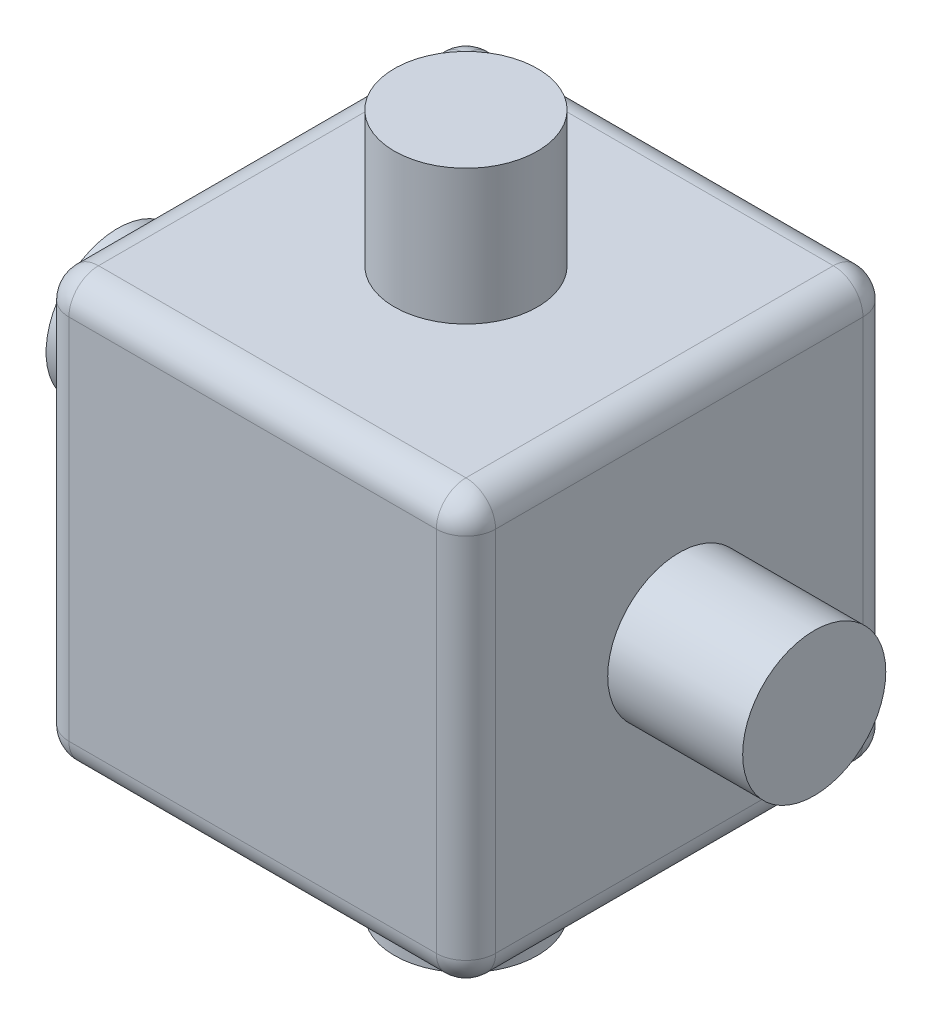
ISO-10303-21;
HEADER;
FILE_DESCRIPTION(('STEP AP214'),'2;1');
FILE_NAME('part.step','',(''),(''),'','','');
FILE_SCHEMA(('AUTOMOTIVE_DESIGN { 1 0 10303 214 1 1 1 1 }'));
ENDSEC;
DATA;
#1=APPLICATION_CONTEXT('core data for automotive mechanical design processes');
#2=APPLICATION_PROTOCOL_DEFINITION('international standard','automotive_design',2000,#1);
#3=PRODUCT_CONTEXT('',#1,'mechanical');
#4=PRODUCT('Part','Part','',(#3));
#5=PRODUCT_RELATED_PRODUCT_CATEGORY('part','',(#4));
#6=PRODUCT_DEFINITION_FORMATION('','',#4);
#7=PRODUCT_DEFINITION_CONTEXT('part definition',#1,'design');
#8=PRODUCT_DEFINITION('design','',#6,#7);
#9=PRODUCT_DEFINITION_SHAPE('','',#8);
#10=(LENGTH_UNIT() NAMED_UNIT(*) SI_UNIT(.MILLI.,.METRE.));
#11=(NAMED_UNIT(*) PLANE_ANGLE_UNIT() SI_UNIT($,.RADIAN.));
#12=(NAMED_UNIT(*) SI_UNIT($,.STERADIAN.) SOLID_ANGLE_UNIT());
#13=UNCERTAINTY_MEASURE_WITH_UNIT(LENGTH_MEASURE(1.E-05),#10,'distance_accuracy_value','');
#14=(GEOMETRIC_REPRESENTATION_CONTEXT(3) GLOBAL_UNCERTAINTY_ASSIGNED_CONTEXT((#13)) GLOBAL_UNIT_ASSIGNED_CONTEXT((#10,
#11,#12)) REPRESENTATION_CONTEXT('',''));
#15=CARTESIAN_POINT('',(0.,0.,0.));
#16=DIRECTION('',(0.,0.,1.));
#17=DIRECTION('',(1.,0.,0.));
#18=AXIS2_PLACEMENT_3D('',#15,#16,#17);
#19=CARTESIAN_POINT('',(7.2,7.2,7.2));
#20=DIRECTION('',(-1.,0.,0.));
#21=DIRECTION('',(0.,0.,1.));
#22=AXIS2_PLACEMENT_3D('',#19,#20,#21);
#23=PLANE('',#22);
#24=DIRECTION('',(0.,-1.,0.));
#25=VECTOR('',#24,1.);
#26=CARTESIAN_POINT('',(7.2,7.2,6.2));
#27=LINE('',#26,#25);
#28=CARTESIAN_POINT('',(7.2,6.2,6.2));
#29=VERTEX_POINT('',#28);
#30=CARTESIAN_POINT('',(7.2,-6.2,6.2));
#31=VERTEX_POINT('',#30);
#32=EDGE_CURVE('E316',#29,#31,#27,.T.);
#33=ORIENTED_EDGE('',*,*,#32,.T.);
#34=DIRECTION('',(0.,0.,-1.));
#35=VECTOR('',#34,1.);
#36=CARTESIAN_POINT('',(7.2,-6.2,7.2));
#37=LINE('',#36,#35);
#38=CARTESIAN_POINT('',(7.2,-6.2,-6.2));
#39=VERTEX_POINT('',#38);
#40=EDGE_CURVE('E319',#31,#39,#37,.T.);
#41=ORIENTED_EDGE('',*,*,#40,.T.);
#42=DIRECTION('',(0.,-1.,0.));
#43=VECTOR('',#42,1.);
#44=CARTESIAN_POINT('',(7.2,7.2,-6.2));
#45=LINE('',#44,#43);
#46=CARTESIAN_POINT('',(7.2,6.2,-6.2));
#47=VERTEX_POINT('',#46);
#48=EDGE_CURVE('E312',#39,#47,#45,.F.);
#49=ORIENTED_EDGE('',*,*,#48,.T.);
#50=DIRECTION('',(0.,0.,-1.));
#51=VECTOR('',#50,1.);
#52=CARTESIAN_POINT('',(7.2,6.2,7.2));
#53=LINE('',#52,#51);
#54=EDGE_CURVE('E165',#47,#29,#53,.F.);
#55=ORIENTED_EDGE('',*,*,#54,.T.);
#56=EDGE_LOOP('',(#33,#41,#49,#55));
#57=FACE_BOUND('',#56,.T.);
#58=CARTESIAN_POINT('',(7.2,0.,0.));
#59=DIRECTION('',(-1.,0.,0.));
#60=DIRECTION('',(0.,0.,1.));
#61=AXIS2_PLACEMENT_3D('',#58,#59,#60);
#62=CIRCLE('',#61,2.415);
#63=CARTESIAN_POINT('',(7.2,0.,2.415));
#64=VERTEX_POINT('',#63);
#65=EDGE_CURVE('E263',#64,#64,#62,.F.);
#66=ORIENTED_EDGE('',*,*,#65,.F.);
#67=EDGE_LOOP('',(#66));
#68=FACE_BOUND('',#67,.T.);
#69=ADVANCED_FACE('F36',(#57,#68),#23,.F.);
#70=CARTESIAN_POINT('',(7.2,7.2,-7.2));
#71=DIRECTION('',(0.,0.,1.));
#72=DIRECTION('',(1.,0.,0.));
#73=AXIS2_PLACEMENT_3D('',#70,#71,#72);
#74=PLANE('',#73);
#75=DIRECTION('',(0.,-1.,0.));
#76=VECTOR('',#75,1.);
#77=CARTESIAN_POINT('',(6.2,7.2,-7.2));
#78=LINE('',#77,#76);
#79=CARTESIAN_POINT('',(6.2,6.2,-7.2));
#80=VERTEX_POINT('',#79);
#81=CARTESIAN_POINT('',(6.2,-6.2,-7.2));
#82=VERTEX_POINT('',#81);
#83=EDGE_CURVE('E46',#80,#82,#78,.T.);
#84=ORIENTED_EDGE('',*,*,#83,.T.);
#85=DIRECTION('',(-1.,0.,0.));
#86=VECTOR('',#85,1.);
#87=CARTESIAN_POINT('',(7.2,-6.2,-7.2));
#88=LINE('',#87,#86);
#89=CARTESIAN_POINT('',(-6.2,-6.2,-7.2));
#90=VERTEX_POINT('',#89);
#91=EDGE_CURVE('E11',#82,#90,#88,.T.);
#92=ORIENTED_EDGE('',*,*,#91,.T.);
#93=DIRECTION('',(0.,-1.,0.));
#94=VECTOR('',#93,1.);
#95=CARTESIAN_POINT('',(-6.2,7.2,-7.2));
#96=LINE('',#95,#94);
#97=CARTESIAN_POINT('',(-6.2,6.2,-7.2));
#98=VERTEX_POINT('',#97);
#99=EDGE_CURVE('E60',#90,#98,#96,.F.);
#100=ORIENTED_EDGE('',*,*,#99,.T.);
#101=DIRECTION('',(-1.,0.,0.));
#102=VECTOR('',#101,1.);
#103=CARTESIAN_POINT('',(7.2,6.2,-7.2));
#104=LINE('',#103,#102);
#105=EDGE_CURVE('E323',#98,#80,#104,.F.);
#106=ORIENTED_EDGE('',*,*,#105,.T.);
#107=EDGE_LOOP('',(#84,#92,#100,#106));
#108=FACE_BOUND('',#107,.T.);
#109=ADVANCED_FACE('F397',(#108),#74,.F.);
#110=CARTESIAN_POINT('',(-7.2,7.2,-7.2));
#111=DIRECTION('',(1.,0.,0.));
#112=DIRECTION('',(0.,0.,-1.));
#113=AXIS2_PLACEMENT_3D('',#110,#111,#112);
#114=PLANE('',#113);
#115=DIRECTION('',(0.,-1.,0.));
#116=VECTOR('',#115,1.);
#117=CARTESIAN_POINT('',(-7.2,7.2,-6.2));
#118=LINE('',#117,#116);
#119=CARTESIAN_POINT('',(-7.2,6.2,-6.2));
#120=VERTEX_POINT('',#119);
#121=CARTESIAN_POINT('',(-7.2,-6.2,-6.2));
#122=VERTEX_POINT('',#121);
#123=EDGE_CURVE('E287',#120,#122,#118,.T.);
#124=ORIENTED_EDGE('',*,*,#123,.T.);
#125=DIRECTION('',(0.,0.,1.));
#126=VECTOR('',#125,1.);
#127=CARTESIAN_POINT('',(-7.2,-6.2,-7.2));
#128=LINE('',#127,#126);
#129=CARTESIAN_POINT('',(-7.2,-6.2,6.2));
#130=VERTEX_POINT('',#129);
#131=EDGE_CURVE('E295',#122,#130,#128,.T.);
#132=ORIENTED_EDGE('',*,*,#131,.T.);
#133=DIRECTION('',(0.,-1.,0.));
#134=VECTOR('',#133,1.);
#135=CARTESIAN_POINT('',(-7.2,7.2,6.2));
#136=LINE('',#135,#134);
#137=CARTESIAN_POINT('',(-7.2,6.2,6.2));
#138=VERTEX_POINT('',#137);
#139=EDGE_CURVE('E292',#130,#138,#136,.F.);
#140=ORIENTED_EDGE('',*,*,#139,.T.);
#141=DIRECTION('',(0.,0.,1.));
#142=VECTOR('',#141,1.);
#143=CARTESIAN_POINT('',(-7.2,6.2,-7.2));
#144=LINE('',#143,#142);
#145=EDGE_CURVE('E289',#138,#120,#144,.F.);
#146=ORIENTED_EDGE('',*,*,#145,.T.);
#147=EDGE_LOOP('',(#124,#132,#140,#146));
#148=FACE_BOUND('',#147,.T.);
#149=CARTESIAN_POINT('',(-7.2,0.,0.));
#150=DIRECTION('',(1.,0.,0.));
#151=DIRECTION('',(0.,0.,-1.));
#152=AXIS2_PLACEMENT_3D('',#149,#150,#151);
#153=CIRCLE('',#152,2.415);
#154=CARTESIAN_POINT('',(-7.2,0.,-2.415));
#155=VERTEX_POINT('',#154);
#156=EDGE_CURVE('E259',#155,#155,#153,.F.);
#157=ORIENTED_EDGE('',*,*,#156,.F.);
#158=EDGE_LOOP('',(#157));
#159=FACE_BOUND('',#158,.T.);
#160=ADVANCED_FACE('F406',(#148,#159),#114,.F.);
#161=CARTESIAN_POINT('',(-7.2,7.2,7.2));
#162=DIRECTION('',(0.,0.,-1.));
#163=DIRECTION('',(-1.,0.,0.));
#164=AXIS2_PLACEMENT_3D('',#161,#162,#163);
#165=PLANE('',#164);
#166=DIRECTION('',(0.,-1.,0.));
#167=VECTOR('',#166,1.);
#168=CARTESIAN_POINT('',(6.2,7.2,7.2));
#169=LINE('',#168,#167);
#170=CARTESIAN_POINT('',(6.2,-6.2,7.2));
#171=VERTEX_POINT('',#170);
#172=CARTESIAN_POINT('',(6.2,6.2,7.2));
#173=VERTEX_POINT('',#172);
#174=EDGE_CURVE('E276',#171,#173,#169,.F.);
#175=ORIENTED_EDGE('',*,*,#174,.T.);
#176=DIRECTION('',(1.,0.,0.));
#177=VECTOR('',#176,1.);
#178=CARTESIAN_POINT('',(-7.2,6.2,7.2));
#179=LINE('',#178,#177);
#180=CARTESIAN_POINT('',(-6.2,6.2,7.2));
#181=VERTEX_POINT('',#180);
#182=EDGE_CURVE('E284',#173,#181,#179,.F.);
#183=ORIENTED_EDGE('',*,*,#182,.T.);
#184=DIRECTION('',(0.,-1.,0.));
#185=VECTOR('',#184,1.);
#186=CARTESIAN_POINT('',(-6.2,7.2,7.2));
#187=LINE('',#186,#185);
#188=CARTESIAN_POINT('',(-6.2,-6.2,7.2));
#189=VERTEX_POINT('',#188);
#190=EDGE_CURVE('E282',#181,#189,#187,.T.);
#191=ORIENTED_EDGE('',*,*,#190,.T.);
#192=DIRECTION('',(1.,0.,0.));
#193=VECTOR('',#192,1.);
#194=CARTESIAN_POINT('',(-7.2,-6.2,7.2));
#195=LINE('',#194,#193);
#196=EDGE_CURVE('E279',#189,#171,#195,.T.);
#197=ORIENTED_EDGE('',*,*,#196,.T.);
#198=EDGE_LOOP('',(#175,#183,#191,#197));
#199=FACE_BOUND('',#198,.T.);
#200=ADVANCED_FACE('F360',(#199),#165,.F.);
#201=CARTESIAN_POINT('',(0.,7.2,0.));
#202=DIRECTION('',(0.,1.,0.));
#203=DIRECTION('',(0.,0.,1.));
#204=AXIS2_PLACEMENT_3D('',#201,#202,#203);
#205=PLANE('',#204);
#206=DIRECTION('',(0.,0.,1.));
#207=VECTOR('',#206,1.);
#208=CARTESIAN_POINT('',(-6.2,7.2,7.2));
#209=LINE('',#208,#207);
#210=CARTESIAN_POINT('',(-6.2,7.2,-6.2));
#211=VERTEX_POINT('',#210);
#212=CARTESIAN_POINT('',(-6.2,7.2,6.2));
#213=VERTEX_POINT('',#212);
#214=EDGE_CURVE('E140',#211,#213,#209,.T.);
#215=ORIENTED_EDGE('',*,*,#214,.T.);
#216=DIRECTION('',(1.,0.,0.));
#217=VECTOR('',#216,1.);
#218=CARTESIAN_POINT('',(7.2,7.2,6.2));
#219=LINE('',#218,#217);
#220=CARTESIAN_POINT('',(6.2,7.2,6.2));
#221=VERTEX_POINT('',#220);
#222=EDGE_CURVE('E135',#213,#221,#219,.T.);
#223=ORIENTED_EDGE('',*,*,#222,.T.);
#224=DIRECTION('',(0.,0.,-1.));
#225=VECTOR('',#224,1.);
#226=CARTESIAN_POINT('',(6.2,7.2,-7.2));
#227=LINE('',#226,#225);
#228=CARTESIAN_POINT('',(6.2,7.2,-6.2));
#229=VERTEX_POINT('',#228);
#230=EDGE_CURVE('E128',#221,#229,#227,.T.);
#231=ORIENTED_EDGE('',*,*,#230,.T.);
#232=DIRECTION('',(-1.,0.,0.));
#233=VECTOR('',#232,1.);
#234=CARTESIAN_POINT('',(-7.2,7.2,-6.2));
#235=LINE('',#234,#233);
#236=EDGE_CURVE('E132',#229,#211,#235,.T.);
#237=ORIENTED_EDGE('',*,*,#236,.T.);
#238=EDGE_LOOP('',(#215,#223,#231,#237));
#239=FACE_BOUND('',#238,.T.);
#240=CARTESIAN_POINT('',(0.,7.2,0.));
#241=DIRECTION('',(0.,1.,0.));
#242=DIRECTION('',(0.,0.,1.));
#243=AXIS2_PLACEMENT_3D('',#240,#241,#242);
#244=CIRCLE('',#243,2.415);
#245=CARTESIAN_POINT('',(0.,7.2,2.415));
#246=VERTEX_POINT('',#245);
#247=EDGE_CURVE('E248',#246,#246,#244,.F.);
#248=ORIENTED_EDGE('',*,*,#247,.T.);
#249=EDGE_LOOP('',(#248));
#250=FACE_BOUND('',#249,.T.);
#251=ADVANCED_FACE('F130',(#239,#250),#205,.T.);
#252=CARTESIAN_POINT('',(0.,-7.2,0.));
#253=DIRECTION('',(0.,1.,0.));
#254=DIRECTION('',(0.,0.,1.));
#255=AXIS2_PLACEMENT_3D('',#252,#253,#254);
#256=PLANE('',#255);
#257=DIRECTION('',(1.,0.,0.));
#258=VECTOR('',#257,1.);
#259=CARTESIAN_POINT('',(0.,-7.2,6.2));
#260=LINE('',#259,#258);
#261=CARTESIAN_POINT('',(6.2,-7.2,6.2));
#262=VERTEX_POINT('',#261);
#263=CARTESIAN_POINT('',(-6.2,-7.2,6.2));
#264=VERTEX_POINT('',#263);
#265=EDGE_CURVE('E305',#262,#264,#260,.F.);
#266=ORIENTED_EDGE('',*,*,#265,.T.);
#267=DIRECTION('',(0.,0.,1.));
#268=VECTOR('',#267,1.);
#269=CARTESIAN_POINT('',(-6.2,-7.2,0.));
#270=LINE('',#269,#268);
#271=CARTESIAN_POINT('',(-6.2,-7.2,-6.2));
#272=VERTEX_POINT('',#271);
#273=EDGE_CURVE('E308',#264,#272,#270,.F.);
#274=ORIENTED_EDGE('',*,*,#273,.T.);
#275=DIRECTION('',(-1.,0.,0.));
#276=VECTOR('',#275,1.);
#277=CARTESIAN_POINT('',(0.,-7.2,-6.2));
#278=LINE('',#277,#276);
#279=CARTESIAN_POINT('',(6.2,-7.2,-6.2));
#280=VERTEX_POINT('',#279);
#281=EDGE_CURVE('E299',#272,#280,#278,.F.);
#282=ORIENTED_EDGE('',*,*,#281,.T.);
#283=DIRECTION('',(0.,0.,-1.));
#284=VECTOR('',#283,1.);
#285=CARTESIAN_POINT('',(6.2,-7.2,0.));
#286=LINE('',#285,#284);
#287=EDGE_CURVE('E302',#280,#262,#286,.F.);
#288=ORIENTED_EDGE('',*,*,#287,.T.);
#289=EDGE_LOOP('',(#266,#274,#282,#288));
#290=FACE_BOUND('',#289,.T.);
#291=CARTESIAN_POINT('',(0.,-7.2,0.));
#292=DIRECTION('',(0.,1.,0.));
#293=DIRECTION('',(0.,0.,1.));
#294=AXIS2_PLACEMENT_3D('',#291,#292,#293);
#295=CIRCLE('',#294,2.415);
#296=CARTESIAN_POINT('',(0.,-7.2,2.415));
#297=VERTEX_POINT('',#296);
#298=EDGE_CURVE('E153',#297,#297,#295,.F.);
#299=ORIENTED_EDGE('',*,*,#298,.F.);
#300=EDGE_LOOP('',(#299));
#301=FACE_BOUND('',#300,.T.);
#302=ADVANCED_FACE('F388',(#290,#301),#256,.F.);
#303=CARTESIAN_POINT('',(-11.755,0.,0.));
#304=DIRECTION('',(1.,0.,0.));
#305=DIRECTION('',(0.,0.,-1.));
#306=AXIS2_PLACEMENT_3D('',#303,#304,#305);
#307=PLANE('',#306);
#308=CARTESIAN_POINT('',(-11.755,0.,0.));
#309=DIRECTION('',(1.,0.,0.));
#310=DIRECTION('',(0.,0.,-1.));
#311=AXIS2_PLACEMENT_3D('',#308,#309,#310);
#312=CIRCLE('',#311,2.415);
#313=CARTESIAN_POINT('',(-11.755,0.,-2.415));
#314=VERTEX_POINT('',#313);
#315=EDGE_CURVE('E254',#314,#314,#312,.T.);
#316=ORIENTED_EDGE('',*,*,#315,.F.);
#317=EDGE_LOOP('',(#316));
#318=FACE_BOUND('',#317,.T.);
#319=ADVANCED_FACE('F598',(#318),#307,.F.);
#320=CARTESIAN_POINT('',(11.755,0.,0.));
#321=DIRECTION('',(-1.,0.,0.));
#322=DIRECTION('',(0.,0.,1.));
#323=AXIS2_PLACEMENT_3D('',#320,#321,#322);
#324=CYLINDRICAL_SURFACE('',#323,2.415);
#325=ORIENTED_EDGE('',*,*,#315,.T.);
#326=EDGE_LOOP('',(#325));
#327=FACE_BOUND('',#326,.T.);
#328=ORIENTED_EDGE('',*,*,#156,.T.);
#329=EDGE_LOOP('',(#328));
#330=FACE_BOUND('',#329,.T.);
#331=ADVANCED_FACE('F689',(#327,#330),#324,.T.);
#332=CARTESIAN_POINT('',(11.755,0.,0.));
#333=DIRECTION('',(1.,0.,0.));
#334=DIRECTION('',(0.,0.,-1.));
#335=AXIS2_PLACEMENT_3D('',#332,#333,#334);
#336=CIRCLE('',#335,2.415);
#337=CARTESIAN_POINT('',(11.755,0.,-2.415));
#338=VERTEX_POINT('',#337);
#339=EDGE_CURVE('E255',#338,#338,#336,.T.);
#340=ORIENTED_EDGE('',*,*,#339,.F.);
#341=EDGE_LOOP('',(#340));
#342=FACE_BOUND('',#341,.T.);
#343=ORIENTED_EDGE('',*,*,#65,.T.);
#344=EDGE_LOOP('',(#343));
#345=FACE_BOUND('',#344,.T.);
#346=ADVANCED_FACE('F679',(#342,#345),#324,.T.);
#347=CARTESIAN_POINT('',(11.755,0.,0.));
#348=DIRECTION('',(1.,0.,0.));
#349=DIRECTION('',(0.,0.,-1.));
#350=AXIS2_PLACEMENT_3D('',#347,#348,#349);
#351=PLANE('',#350);
#352=ORIENTED_EDGE('',*,*,#339,.T.);
#353=EDGE_LOOP('',(#352));
#354=FACE_BOUND('',#353,.T.);
#355=ADVANCED_FACE('F669',(#354),#351,.T.);
#356=CARTESIAN_POINT('',(0.,-11.755,0.));
#357=DIRECTION('',(0.,1.,0.));
#358=DIRECTION('',(0.,0.,1.));
#359=AXIS2_PLACEMENT_3D('',#356,#357,#358);
#360=PLANE('',#359);
#361=CARTESIAN_POINT('',(0.,-11.755,0.));
#362=DIRECTION('',(0.,1.,0.));
#363=DIRECTION('',(0.,0.,1.));
#364=AXIS2_PLACEMENT_3D('',#361,#362,#363);
#365=CIRCLE('',#364,2.415);
#366=CARTESIAN_POINT('',(0.,-11.755,2.415));
#367=VERTEX_POINT('',#366);
#368=EDGE_CURVE('E232',#367,#367,#365,.T.);
#369=ORIENTED_EDGE('',*,*,#368,.F.);
#370=EDGE_LOOP('',(#369));
#371=FACE_BOUND('',#370,.T.);
#372=ADVANCED_FACE('F661',(#371),#360,.F.);
#373=CARTESIAN_POINT('',(0.,11.755,0.));
#374=DIRECTION('',(0.,-1.,0.));
#375=DIRECTION('',(0.,0.,-1.));
#376=AXIS2_PLACEMENT_3D('',#373,#374,#375);
#377=CYLINDRICAL_SURFACE('',#376,2.415);
#378=ORIENTED_EDGE('',*,*,#368,.T.);
#379=EDGE_LOOP('',(#378));
#380=FACE_BOUND('',#379,.T.);
#381=ORIENTED_EDGE('',*,*,#298,.T.);
#382=EDGE_LOOP('',(#381));
#383=FACE_BOUND('',#382,.T.);
#384=ADVANCED_FACE('F651',(#380,#383),#377,.T.);
#385=ORIENTED_EDGE('',*,*,#247,.F.);
#386=EDGE_LOOP('',(#385));
#387=FACE_BOUND('',#386,.T.);
#388=CARTESIAN_POINT('',(0.,11.755,0.));
#389=DIRECTION('',(0.,1.,0.));
#390=DIRECTION('',(0.,0.,1.));
#391=AXIS2_PLACEMENT_3D('',#388,#389,#390);
#392=CIRCLE('',#391,2.415);
#393=CARTESIAN_POINT('',(0.,11.755,2.415));
#394=VERTEX_POINT('',#393);
#395=EDGE_CURVE('E241',#394,#394,#392,.T.);
#396=ORIENTED_EDGE('',*,*,#395,.F.);
#397=EDGE_LOOP('',(#396));
#398=FACE_BOUND('',#397,.T.);
#399=ADVANCED_FACE('F641',(#387,#398),#377,.T.);
#400=CARTESIAN_POINT('',(0.,11.755,0.));
#401=DIRECTION('',(0.,1.,0.));
#402=DIRECTION('',(0.,0.,1.));
#403=AXIS2_PLACEMENT_3D('',#400,#401,#402);
#404=PLANE('',#403);
#405=ORIENTED_EDGE('',*,*,#395,.T.);
#406=EDGE_LOOP('',(#405));
#407=FACE_BOUND('',#406,.T.);
#408=ADVANCED_FACE('F588',(#407),#404,.T.);
#409=CARTESIAN_POINT('',(7.2,-6.2,-6.2));
#410=DIRECTION('',(-1.,0.,0.));
#411=DIRECTION('',(0.,0.,1.));
#412=AXIS2_PLACEMENT_3D('',#409,#410,#411);
#413=CYLINDRICAL_SURFACE('',#412,1.);
#414=CARTESIAN_POINT('',(-6.2,-6.2,-6.2));
#415=DIRECTION('',(-1.,0.,0.));
#416=DIRECTION('',(0.,0.,1.));
#417=AXIS2_PLACEMENT_3D('',#414,#415,#416);
#418=CIRCLE('',#417,1.);
#419=EDGE_CURVE('E40',#90,#272,#418,.T.);
#420=ORIENTED_EDGE('',*,*,#419,.F.);
#421=ORIENTED_EDGE('',*,*,#91,.F.);
#422=CARTESIAN_POINT('',(6.2,-6.2,-6.2));
#423=DIRECTION('',(1.,0.,0.));
#424=DIRECTION('',(0.,0.,-1.));
#425=AXIS2_PLACEMENT_3D('',#422,#423,#424);
#426=CIRCLE('',#425,1.);
#427=EDGE_CURVE('E222',#280,#82,#426,.T.);
#428=ORIENTED_EDGE('',*,*,#427,.F.);
#429=ORIENTED_EDGE('',*,*,#281,.F.);
#430=EDGE_LOOP('',(#420,#421,#428,#429));
#431=FACE_BOUND('',#430,.T.);
#432=ADVANCED_FACE('F38',(#431),#413,.T.);
#433=CARTESIAN_POINT('',(-6.2,-6.2,-6.2));
#434=DIRECTION('',(0.,0.,1.));
#435=DIRECTION('',(1.,0.,0.));
#436=AXIS2_PLACEMENT_3D('',#433,#434,#435);
#437=SPHERICAL_SURFACE('',#436,1.);
#438=CARTESIAN_POINT('',(-6.2,-6.2,-6.2));
#439=DIRECTION('',(0.,-1.,0.));
#440=DIRECTION('',(0.,0.,-1.));
#441=AXIS2_PLACEMENT_3D('',#438,#439,#440);
#442=CIRCLE('',#441,1.);
#443=EDGE_CURVE('E217',#90,#122,#442,.F.);
#444=ORIENTED_EDGE('',*,*,#443,.F.);
#445=ORIENTED_EDGE('',*,*,#419,.T.);
#446=CARTESIAN_POINT('',(-6.2,-6.2,-6.2));
#447=DIRECTION('',(0.,0.,-1.));
#448=DIRECTION('',(-1.,0.,0.));
#449=AXIS2_PLACEMENT_3D('',#446,#447,#448);
#450=CIRCLE('',#449,1.);
#451=EDGE_CURVE('E220',#122,#272,#450,.F.);
#452=ORIENTED_EDGE('',*,*,#451,.F.);
#453=EDGE_LOOP('',(#444,#445,#452));
#454=FACE_BOUND('',#453,.T.);
#455=ADVANCED_FACE('F394',(#454),#437,.T.);
#456=CARTESIAN_POINT('',(6.2,-6.2,-6.2));
#457=DIRECTION('',(0.,0.,1.));
#458=DIRECTION('',(1.,0.,0.));
#459=AXIS2_PLACEMENT_3D('',#456,#457,#458);
#460=SPHERICAL_SURFACE('',#459,1.);
#461=CARTESIAN_POINT('',(6.2,-6.2,-6.2));
#462=DIRECTION('',(0.,0.,-1.));
#463=DIRECTION('',(-1.,0.,0.));
#464=AXIS2_PLACEMENT_3D('',#461,#462,#463);
#465=CIRCLE('',#464,1.);
#466=EDGE_CURVE('E209',#280,#39,#465,.F.);
#467=ORIENTED_EDGE('',*,*,#466,.F.);
#468=ORIENTED_EDGE('',*,*,#427,.T.);
#469=CARTESIAN_POINT('',(6.2,-6.2,-6.2));
#470=DIRECTION('',(0.,-1.,0.));
#471=DIRECTION('',(0.,0.,-1.));
#472=AXIS2_PLACEMENT_3D('',#469,#470,#471);
#473=CIRCLE('',#472,1.);
#474=EDGE_CURVE('E213',#39,#82,#473,.F.);
#475=ORIENTED_EDGE('',*,*,#474,.F.);
#476=EDGE_LOOP('',(#467,#468,#475));
#477=FACE_BOUND('',#476,.T.);
#478=ADVANCED_FACE('F564',(#477),#460,.T.);
#479=CARTESIAN_POINT('',(-6.2,-6.2,-7.2));
#480=DIRECTION('',(0.,0.,1.));
#481=DIRECTION('',(1.,0.,0.));
#482=AXIS2_PLACEMENT_3D('',#479,#480,#481);
#483=CYLINDRICAL_SURFACE('',#482,1.);
#484=ORIENTED_EDGE('',*,*,#451,.T.);
#485=ORIENTED_EDGE('',*,*,#273,.F.);
#486=CARTESIAN_POINT('',(-6.2,-6.2,6.2));
#487=DIRECTION('',(0.,0.,1.));
#488=DIRECTION('',(1.,0.,0.));
#489=AXIS2_PLACEMENT_3D('',#486,#487,#488);
#490=CIRCLE('',#489,1.);
#491=EDGE_CURVE('E201',#130,#264,#490,.T.);
#492=ORIENTED_EDGE('',*,*,#491,.F.);
#493=ORIENTED_EDGE('',*,*,#131,.F.);
#494=EDGE_LOOP('',(#484,#485,#492,#493));
#495=FACE_BOUND('',#494,.T.);
#496=ADVANCED_FACE('F392',(#495),#483,.T.);
#497=CARTESIAN_POINT('',(-6.2,7.2,-6.2));
#498=DIRECTION('',(0.,-1.,0.));
#499=DIRECTION('',(0.,0.,-1.));
#500=AXIS2_PLACEMENT_3D('',#497,#498,#499);
#501=CYLINDRICAL_SURFACE('',#500,1.);
#502=ORIENTED_EDGE('',*,*,#443,.T.);
#503=ORIENTED_EDGE('',*,*,#123,.F.);
#504=CARTESIAN_POINT('',(-6.2,6.2,-6.2));
#505=DIRECTION('',(0.,1.,0.));
#506=DIRECTION('',(0.,0.,1.));
#507=AXIS2_PLACEMENT_3D('',#504,#505,#506);
#508=CIRCLE('',#507,1.);
#509=EDGE_CURVE('E197',#98,#120,#508,.T.);
#510=ORIENTED_EDGE('',*,*,#509,.F.);
#511=ORIENTED_EDGE('',*,*,#99,.F.);
#512=EDGE_LOOP('',(#502,#503,#510,#511));
#513=FACE_BOUND('',#512,.T.);
#514=ADVANCED_FACE('F398',(#513),#501,.T.);
#515=CARTESIAN_POINT('',(0.,6.2,-6.2));
#516=DIRECTION('',(1.,0.,0.));
#517=DIRECTION('',(0.,0.,-1.));
#518=AXIS2_PLACEMENT_3D('',#515,#516,#517);
#519=CYLINDRICAL_SURFACE('',#518,1.);
#520=CARTESIAN_POINT('',(6.2,6.2,-6.2));
#521=DIRECTION('',(1.,0.,0.));
#522=DIRECTION('',(0.,0.,-1.));
#523=AXIS2_PLACEMENT_3D('',#520,#521,#522);
#524=CIRCLE('',#523,1.);
#525=EDGE_CURVE('E147',#80,#229,#524,.T.);
#526=ORIENTED_EDGE('',*,*,#525,.F.);
#527=ORIENTED_EDGE('',*,*,#105,.F.);
#528=CARTESIAN_POINT('',(-6.2,6.2,-6.2));
#529=DIRECTION('',(-1.,0.,0.));
#530=DIRECTION('',(0.,0.,1.));
#531=AXIS2_PLACEMENT_3D('',#528,#529,#530);
#532=CIRCLE('',#531,1.);
#533=EDGE_CURVE('E150',#211,#98,#532,.T.);
#534=ORIENTED_EDGE('',*,*,#533,.F.);
#535=ORIENTED_EDGE('',*,*,#236,.F.);
#536=EDGE_LOOP('',(#526,#527,#534,#535));
#537=FACE_BOUND('',#536,.T.);
#538=ADVANCED_FACE('F145',(#537),#519,.T.);
#539=CARTESIAN_POINT('',(6.2,7.2,-6.2));
#540=DIRECTION('',(0.,-1.,0.));
#541=DIRECTION('',(0.,0.,-1.));
#542=AXIS2_PLACEMENT_3D('',#539,#540,#541);
#543=CYLINDRICAL_SURFACE('',#542,1.);
#544=ORIENTED_EDGE('',*,*,#474,.T.);
#545=ORIENTED_EDGE('',*,*,#83,.F.);
#546=CARTESIAN_POINT('',(6.2,6.2,-6.2));
#547=DIRECTION('',(0.,1.,0.));
#548=DIRECTION('',(0.,0.,1.));
#549=AXIS2_PLACEMENT_3D('',#546,#547,#548);
#550=CIRCLE('',#549,1.);
#551=EDGE_CURVE('E161',#47,#80,#550,.T.);
#552=ORIENTED_EDGE('',*,*,#551,.F.);
#553=ORIENTED_EDGE('',*,*,#48,.F.);
#554=EDGE_LOOP('',(#544,#545,#552,#553));
#555=FACE_BOUND('',#554,.T.);
#556=ADVANCED_FACE('F530',(#555),#543,.T.);
#557=CARTESIAN_POINT('',(6.2,-6.2,7.2));
#558=DIRECTION('',(0.,0.,-1.));
#559=DIRECTION('',(-1.,0.,0.));
#560=AXIS2_PLACEMENT_3D('',#557,#558,#559);
#561=CYLINDRICAL_SURFACE('',#560,1.);
#562=ORIENTED_EDGE('',*,*,#466,.T.);
#563=ORIENTED_EDGE('',*,*,#40,.F.);
#564=CARTESIAN_POINT('',(6.2,-6.2,6.2));
#565=DIRECTION('',(0.,0.,1.));
#566=DIRECTION('',(1.,0.,0.));
#567=AXIS2_PLACEMENT_3D('',#564,#565,#566);
#568=CIRCLE('',#567,1.);
#569=EDGE_CURVE('E189',#262,#31,#568,.T.);
#570=ORIENTED_EDGE('',*,*,#569,.F.);
#571=ORIENTED_EDGE('',*,*,#287,.F.);
#572=EDGE_LOOP('',(#562,#563,#570,#571));
#573=FACE_BOUND('',#572,.T.);
#574=ADVANCED_FACE('F377',(#573),#561,.T.);
#575=CARTESIAN_POINT('',(-7.2,-6.2,6.2));
#576=DIRECTION('',(1.,0.,0.));
#577=DIRECTION('',(0.,0.,-1.));
#578=AXIS2_PLACEMENT_3D('',#575,#576,#577);
#579=CYLINDRICAL_SURFACE('',#578,1.);
#580=CARTESIAN_POINT('',(-6.2,-6.2,6.2));
#581=DIRECTION('',(-1.,0.,0.));
#582=DIRECTION('',(0.,0.,1.));
#583=AXIS2_PLACEMENT_3D('',#580,#581,#582);
#584=CIRCLE('',#583,1.);
#585=EDGE_CURVE('E205',#264,#189,#584,.T.);
#586=ORIENTED_EDGE('',*,*,#585,.F.);
#587=ORIENTED_EDGE('',*,*,#265,.F.);
#588=CARTESIAN_POINT('',(6.2,-6.2,6.2));
#589=DIRECTION('',(1.,0.,0.));
#590=DIRECTION('',(0.,0.,-1.));
#591=AXIS2_PLACEMENT_3D('',#588,#589,#590);
#592=CIRCLE('',#591,1.);
#593=EDGE_CURVE('E185',#171,#262,#592,.T.);
#594=ORIENTED_EDGE('',*,*,#593,.F.);
#595=ORIENTED_EDGE('',*,*,#196,.F.);
#596=EDGE_LOOP('',(#586,#587,#594,#595));
#597=FACE_BOUND('',#596,.T.);
#598=ADVANCED_FACE('F385',(#597),#579,.T.);
#599=CARTESIAN_POINT('',(-6.2,-6.2,6.2));
#600=DIRECTION('',(0.,0.,1.));
#601=DIRECTION('',(1.,0.,0.));
#602=AXIS2_PLACEMENT_3D('',#599,#600,#601);
#603=SPHERICAL_SURFACE('',#602,1.);
#604=ORIENTED_EDGE('',*,*,#491,.T.);
#605=ORIENTED_EDGE('',*,*,#585,.T.);
#606=CARTESIAN_POINT('',(-6.2,-6.2,6.2));
#607=DIRECTION('',(0.,-1.,0.));
#608=DIRECTION('',(0.,0.,-1.));
#609=AXIS2_PLACEMENT_3D('',#606,#607,#608);
#610=CIRCLE('',#609,1.);
#611=EDGE_CURVE('E174',#130,#189,#610,.F.);
#612=ORIENTED_EDGE('',*,*,#611,.F.);
#613=EDGE_LOOP('',(#604,#605,#612));
#614=FACE_BOUND('',#613,.T.);
#615=ADVANCED_FACE('F409',(#614),#603,.T.);
#616=CARTESIAN_POINT('',(-6.2,6.2,-6.2));
#617=DIRECTION('',(0.,0.,1.));
#618=DIRECTION('',(1.,0.,0.));
#619=AXIS2_PLACEMENT_3D('',#616,#617,#618);
#620=SPHERICAL_SURFACE('',#619,1.);
#621=ORIENTED_EDGE('',*,*,#533,.T.);
#622=ORIENTED_EDGE('',*,*,#509,.T.);
#623=CARTESIAN_POINT('',(-6.2,6.2,-6.2));
#624=DIRECTION('',(0.,0.,-1.));
#625=DIRECTION('',(-1.,0.,0.));
#626=AXIS2_PLACEMENT_3D('',#623,#624,#625);
#627=CIRCLE('',#626,1.);
#628=EDGE_CURVE('E167',#211,#120,#627,.F.);
#629=ORIENTED_EDGE('',*,*,#628,.F.);
#630=EDGE_LOOP('',(#621,#622,#629));
#631=FACE_BOUND('',#630,.T.);
#632=ADVANCED_FACE('F400',(#631),#620,.T.);
#633=CARTESIAN_POINT('',(6.2,6.2,-6.2));
#634=DIRECTION('',(0.,0.,1.));
#635=DIRECTION('',(1.,0.,0.));
#636=AXIS2_PLACEMENT_3D('',#633,#634,#635);
#637=SPHERICAL_SURFACE('',#636,1.);
#638=ORIENTED_EDGE('',*,*,#551,.T.);
#639=ORIENTED_EDGE('',*,*,#525,.T.);
#640=CARTESIAN_POINT('',(6.2,6.2,-6.2));
#641=DIRECTION('',(0.,0.,-1.));
#642=DIRECTION('',(-1.,0.,0.));
#643=AXIS2_PLACEMENT_3D('',#640,#641,#642);
#644=CIRCLE('',#643,1.);
#645=EDGE_CURVE('E158',#47,#229,#644,.F.);
#646=ORIENTED_EDGE('',*,*,#645,.F.);
#647=EDGE_LOOP('',(#638,#639,#646));
#648=FACE_BOUND('',#647,.T.);
#649=ADVANCED_FACE('F157',(#648),#637,.T.);
#650=CARTESIAN_POINT('',(6.2,-6.2,6.2));
#651=DIRECTION('',(0.,0.,1.));
#652=DIRECTION('',(1.,0.,0.));
#653=AXIS2_PLACEMENT_3D('',#650,#651,#652);
#654=SPHERICAL_SURFACE('',#653,1.);
#655=ORIENTED_EDGE('',*,*,#593,.T.);
#656=ORIENTED_EDGE('',*,*,#569,.T.);
#657=CARTESIAN_POINT('',(6.2,-6.2,6.2));
#658=DIRECTION('',(0.,-1.,0.));
#659=DIRECTION('',(0.,0.,-1.));
#660=AXIS2_PLACEMENT_3D('',#657,#658,#659);
#661=CIRCLE('',#660,1.);
#662=EDGE_CURVE('E168',#171,#31,#661,.F.);
#663=ORIENTED_EDGE('',*,*,#662,.F.);
#664=EDGE_LOOP('',(#655,#656,#663));
#665=FACE_BOUND('',#664,.T.);
#666=ADVANCED_FACE('F380',(#665),#654,.T.);
#667=CARTESIAN_POINT('',(-6.2,7.2,6.2));
#668=DIRECTION('',(0.,-1.,0.));
#669=DIRECTION('',(0.,0.,-1.));
#670=AXIS2_PLACEMENT_3D('',#667,#668,#669);
#671=CYLINDRICAL_SURFACE('',#670,1.);
#672=ORIENTED_EDGE('',*,*,#611,.T.);
#673=ORIENTED_EDGE('',*,*,#190,.F.);
#674=CARTESIAN_POINT('',(-6.2,6.2,6.2));
#675=DIRECTION('',(0.,1.,0.));
#676=DIRECTION('',(0.,0.,1.));
#677=AXIS2_PLACEMENT_3D('',#674,#675,#676);
#678=CIRCLE('',#677,1.);
#679=EDGE_CURVE('E178',#138,#181,#678,.T.);
#680=ORIENTED_EDGE('',*,*,#679,.F.);
#681=ORIENTED_EDGE('',*,*,#139,.F.);
#682=EDGE_LOOP('',(#672,#673,#680,#681));
#683=FACE_BOUND('',#682,.T.);
#684=ADVANCED_FACE('F355',(#683),#671,.T.);
#685=CARTESIAN_POINT('',(-6.2,6.2,0.));
#686=DIRECTION('',(0.,0.,-1.));
#687=DIRECTION('',(-1.,0.,0.));
#688=AXIS2_PLACEMENT_3D('',#685,#686,#687);
#689=CYLINDRICAL_SURFACE('',#688,1.);
#690=ORIENTED_EDGE('',*,*,#628,.T.);
#691=ORIENTED_EDGE('',*,*,#145,.F.);
#692=CARTESIAN_POINT('',(-6.2,6.2,6.2));
#693=DIRECTION('',(0.,0.,1.));
#694=DIRECTION('',(1.,0.,0.));
#695=AXIS2_PLACEMENT_3D('',#692,#693,#694);
#696=CIRCLE('',#695,1.);
#697=EDGE_CURVE('E344',#213,#138,#696,.T.);
#698=ORIENTED_EDGE('',*,*,#697,.F.);
#699=ORIENTED_EDGE('',*,*,#214,.F.);
#700=EDGE_LOOP('',(#690,#691,#698,#699));
#701=FACE_BOUND('',#700,.T.);
#702=ADVANCED_FACE('F404',(#701),#689,.T.);
#703=CARTESIAN_POINT('',(6.2,6.2,0.));
#704=DIRECTION('',(0.,0.,1.));
#705=DIRECTION('',(1.,0.,0.));
#706=AXIS2_PLACEMENT_3D('',#703,#704,#705);
#707=CYLINDRICAL_SURFACE('',#706,1.);
#708=ORIENTED_EDGE('',*,*,#645,.T.);
#709=ORIENTED_EDGE('',*,*,#230,.F.);
#710=CARTESIAN_POINT('',(6.2,6.2,6.2));
#711=DIRECTION('',(0.,0.,1.));
#712=DIRECTION('',(1.,0.,0.));
#713=AXIS2_PLACEMENT_3D('',#710,#711,#712);
#714=CIRCLE('',#713,1.);
#715=EDGE_CURVE('E340',#29,#221,#714,.T.);
#716=ORIENTED_EDGE('',*,*,#715,.F.);
#717=ORIENTED_EDGE('',*,*,#54,.F.);
#718=EDGE_LOOP('',(#708,#709,#716,#717));
#719=FACE_BOUND('',#718,.T.);
#720=ADVANCED_FACE('F164',(#719),#707,.T.);
#721=CARTESIAN_POINT('',(6.2,7.2,6.2));
#722=DIRECTION('',(0.,-1.,0.));
#723=DIRECTION('',(0.,0.,-1.));
#724=AXIS2_PLACEMENT_3D('',#721,#722,#723);
#725=CYLINDRICAL_SURFACE('',#724,1.);
#726=ORIENTED_EDGE('',*,*,#662,.T.);
#727=ORIENTED_EDGE('',*,*,#32,.F.);
#728=CARTESIAN_POINT('',(6.2,6.2,6.2));
#729=DIRECTION('',(0.,1.,0.));
#730=DIRECTION('',(0.,0.,1.));
#731=AXIS2_PLACEMENT_3D('',#728,#729,#730);
#732=CIRCLE('',#731,1.);
#733=EDGE_CURVE('E336',#173,#29,#732,.T.);
#734=ORIENTED_EDGE('',*,*,#733,.F.);
#735=ORIENTED_EDGE('',*,*,#174,.F.);
#736=EDGE_LOOP('',(#726,#727,#734,#735));
#737=FACE_BOUND('',#736,.T.);
#738=ADVANCED_FACE('F370',(#737),#725,.T.);
#739=CARTESIAN_POINT('',(-6.2,6.2,6.2));
#740=DIRECTION('',(0.,0.,1.));
#741=DIRECTION('',(1.,0.,0.));
#742=AXIS2_PLACEMENT_3D('',#739,#740,#741);
#743=SPHERICAL_SURFACE('',#742,1.);
#744=ORIENTED_EDGE('',*,*,#697,.T.);
#745=ORIENTED_EDGE('',*,*,#679,.T.);
#746=CARTESIAN_POINT('',(-6.2,6.2,6.2));
#747=DIRECTION('',(-1.,0.,0.));
#748=DIRECTION('',(0.,0.,1.));
#749=AXIS2_PLACEMENT_3D('',#746,#747,#748);
#750=CIRCLE('',#749,1.);
#751=EDGE_CURVE('E333',#213,#181,#750,.F.);
#752=ORIENTED_EDGE('',*,*,#751,.F.);
#753=EDGE_LOOP('',(#744,#745,#752));
#754=FACE_BOUND('',#753,.T.);
#755=ADVANCED_FACE('F352',(#754),#743,.T.);
#756=CARTESIAN_POINT('',(6.2,6.2,6.2));
#757=DIRECTION('',(0.,0.,1.));
#758=DIRECTION('',(1.,0.,0.));
#759=AXIS2_PLACEMENT_3D('',#756,#757,#758);
#760=SPHERICAL_SURFACE('',#759,1.);
#761=ORIENTED_EDGE('',*,*,#733,.T.);
#762=ORIENTED_EDGE('',*,*,#715,.T.);
#763=CARTESIAN_POINT('',(6.2,6.2,6.2));
#764=DIRECTION('',(1.,0.,0.));
#765=DIRECTION('',(0.,0.,-1.));
#766=AXIS2_PLACEMENT_3D('',#763,#764,#765);
#767=CIRCLE('',#766,1.);
#768=EDGE_CURVE('E330',#173,#221,#767,.F.);
#769=ORIENTED_EDGE('',*,*,#768,.F.);
#770=EDGE_LOOP('',(#761,#762,#769));
#771=FACE_BOUND('',#770,.T.);
#772=ADVANCED_FACE('F367',(#771),#760,.T.);
#773=CARTESIAN_POINT('',(0.,6.2,6.2));
#774=DIRECTION('',(-1.,0.,0.));
#775=DIRECTION('',(0.,0.,1.));
#776=AXIS2_PLACEMENT_3D('',#773,#774,#775);
#777=CYLINDRICAL_SURFACE('',#776,1.);
#778=ORIENTED_EDGE('',*,*,#751,.T.);
#779=ORIENTED_EDGE('',*,*,#182,.F.);
#780=ORIENTED_EDGE('',*,*,#768,.T.);
#781=ORIENTED_EDGE('',*,*,#222,.F.);
#782=EDGE_LOOP('',(#778,#779,#780,#781));
#783=FACE_BOUND('',#782,.T.);
#784=ADVANCED_FACE('F365',(#783),#777,.T.);
#785=CLOSED_SHELL('',(#69,#109,#160,#200,#251,#302,#319,#331,#346,#355,#372,#384,#399,#408,#432,
#455,#478,#496,#514,#538,#556,#574,#598,#615,#632,#649,#666,#684,#702,#720,#738,#755,#772,#784));
#786=MANIFOLD_SOLID_BREP('B2',#785);
#787=ADVANCED_BREP_SHAPE_REPRESENTATION('',(#18,#786),#14);
#788=SHAPE_DEFINITION_REPRESENTATION(#9,#787);
ENDSEC;
END-ISO-10303-21;
